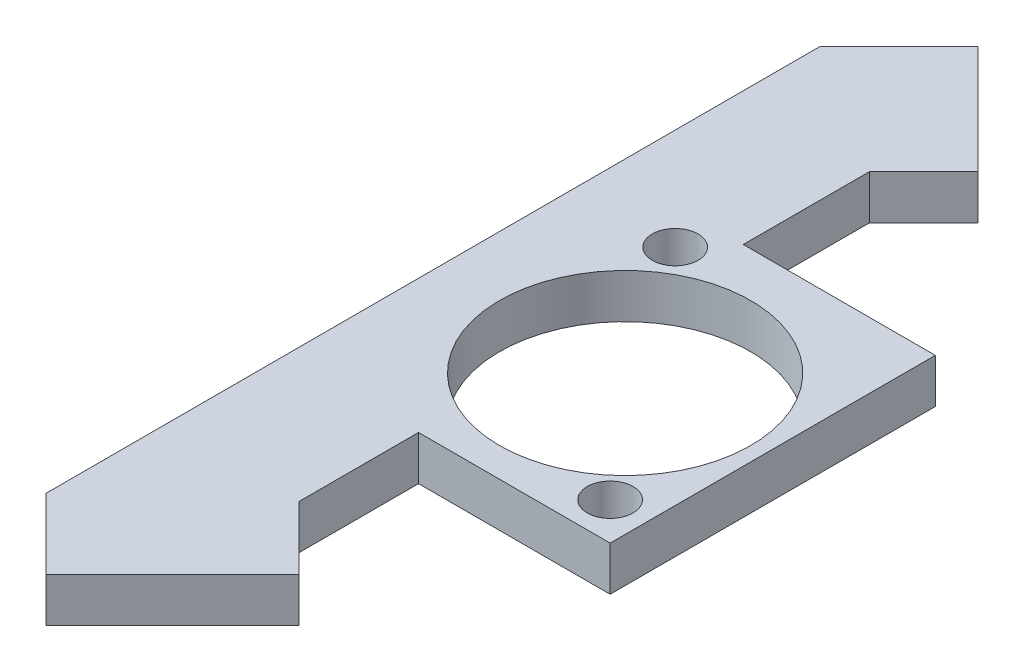
ISO-10303-21;
HEADER;
FILE_DESCRIPTION(('STEP AP214'),'2;1');
FILE_NAME('part.step','',(''),(''),'','','');
FILE_SCHEMA(('AUTOMOTIVE_DESIGN { 1 0 10303 214 1 1 1 1 }'));
ENDSEC;
DATA;
#1=APPLICATION_CONTEXT('core data for automotive mechanical design processes');
#2=APPLICATION_PROTOCOL_DEFINITION('international standard','automotive_design',2000,#1);
#3=PRODUCT_CONTEXT('',#1,'mechanical');
#4=PRODUCT('Part','Part','',(#3));
#5=PRODUCT_RELATED_PRODUCT_CATEGORY('part','',(#4));
#6=PRODUCT_DEFINITION_FORMATION('','',#4);
#7=PRODUCT_DEFINITION_CONTEXT('part definition',#1,'design');
#8=PRODUCT_DEFINITION('design','',#6,#7);
#9=PRODUCT_DEFINITION_SHAPE('','',#8);
#10=(LENGTH_UNIT() NAMED_UNIT(*) SI_UNIT(.MILLI.,.METRE.));
#11=(NAMED_UNIT(*) PLANE_ANGLE_UNIT() SI_UNIT($,.RADIAN.));
#12=(NAMED_UNIT(*) SI_UNIT($,.STERADIAN.) SOLID_ANGLE_UNIT());
#13=UNCERTAINTY_MEASURE_WITH_UNIT(LENGTH_MEASURE(1.E-05),#10,'distance_accuracy_value','');
#14=(GEOMETRIC_REPRESENTATION_CONTEXT(3) GLOBAL_UNCERTAINTY_ASSIGNED_CONTEXT((#13)) GLOBAL_UNIT_ASSIGNED_CONTEXT((#10,
#11,#12)) REPRESENTATION_CONTEXT('',''));
#15=CARTESIAN_POINT('',(0.,0.,0.));
#16=DIRECTION('',(0.,0.,1.));
#17=DIRECTION('',(1.,0.,0.));
#18=AXIS2_PLACEMENT_3D('',#15,#16,#17);
#19=CARTESIAN_POINT('',(-38.7655858067089,3.,-0.176708997531649));
#20=DIRECTION('',(0.,0.,-1.));
#21=DIRECTION('',(-1.,0.,0.));
#22=AXIS2_PLACEMENT_3D('',#19,#20,#21);
#23=PLANE('',#22);
#24=DIRECTION('',(0.,1.,0.));
#25=VECTOR('',#24,1.);
#26=CARTESIAN_POINT('',(-29.7285313034324,0.,-0.176708997531649));
#27=LINE('',#26,#25);
#28=CARTESIAN_POINT('',(-29.7285313034324,0.,-0.176708997531649));
#29=VERTEX_POINT('',#28);
#30=CARTESIAN_POINT('',(-29.7285313034324,3.,-0.176708997531649));
#31=VERTEX_POINT('',#30);
#32=EDGE_CURVE('E61',#29,#31,#27,.T.);
#33=ORIENTED_EDGE('',*,*,#32,.F.);
#34=DIRECTION('',(1.,0.,0.));
#35=VECTOR('',#34,1.);
#36=CARTESIAN_POINT('',(-38.7655858067089,0.,-0.176708997531649));
#37=LINE('',#36,#35);
#38=CARTESIAN_POINT('',(-16.7655858067089,0.,-0.176708997531649));
#39=VERTEX_POINT('',#38);
#40=EDGE_CURVE('E157',#29,#39,#37,.T.);
#41=ORIENTED_EDGE('',*,*,#40,.T.);
#42=DIRECTION('',(0.,-1.,0.));
#43=VECTOR('',#42,1.);
#44=CARTESIAN_POINT('',(-16.7655858067089,3.,-0.176708997531649));
#45=LINE('',#44,#43);
#46=CARTESIAN_POINT('',(-16.7655858067089,3.,-0.176708997531649));
#47=VERTEX_POINT('',#46);
#48=EDGE_CURVE('E12',#47,#39,#45,.T.);
#49=ORIENTED_EDGE('',*,*,#48,.F.);
#50=DIRECTION('',(1.,0.,0.));
#51=VECTOR('',#50,1.);
#52=CARTESIAN_POINT('',(-38.7655858067089,3.,-0.176708997531649));
#53=LINE('',#52,#51);
#54=EDGE_CURVE('E155',#31,#47,#53,.T.);
#55=ORIENTED_EDGE('',*,*,#54,.F.);
#56=EDGE_LOOP('',(#33,#41,#49,#55));
#57=FACE_BOUND('',#56,.T.);
#58=ADVANCED_FACE('F38',(#57),#23,.F.);
#59=CARTESIAN_POINT('',(0.,3.,0.));
#60=DIRECTION('',(0.,1.,0.));
#61=DIRECTION('',(0.,0.,1.));
#62=AXIS2_PLACEMENT_3D('',#59,#60,#61);
#63=PLANE('',#62);
#64=CARTESIAN_POINT('',(-19.3055858067089,3.,-2.71670899753165));
#65=DIRECTION('',(0.,1.,0.));
#66=DIRECTION('',(0.,0.,1.));
#67=AXIS2_PLACEMENT_3D('',#64,#65,#66);
#68=CIRCLE('',#67,1.55);
#69=CARTESIAN_POINT('',(-19.3055858067089,3.,-1.16670899753165));
#70=VERTEX_POINT('',#69);
#71=EDGE_CURVE('E208',#70,#70,#68,.T.);
#72=ORIENTED_EDGE('',*,*,#71,.F.);
#73=EDGE_LOOP('',(#72));
#74=FACE_BOUND('',#73,.T.);
#75=DIRECTION('',(0.,0.,1.));
#76=VECTOR('',#75,1.);
#77=CARTESIAN_POINT('',(-38.7655858067089,3.,-22.1767089975316));
#78=LINE('',#77,#76);
#79=CARTESIAN_POINT('',(-38.7655858067089,3.,-36.3897025324134));
#80=VERTEX_POINT('',#79);
#81=CARTESIAN_POINT('',(-38.7655858067089,3.,15.9918306806642));
#82=VERTEX_POINT('',#81);
#83=EDGE_CURVE('E151',#80,#82,#78,.T.);
#84=ORIENTED_EDGE('',*,*,#83,.T.);
#85=DIRECTION('',(0.707106781186559,0.,0.707106781186536));
#86=VECTOR('',#85,1.);
#87=CARTESIAN_POINT('',(-38.7655858067089,3.,15.9918306806642));
#88=LINE('',#87,#86);
#89=CARTESIAN_POINT('',(-34.011681836265,3.,20.7457346511078));
#90=VERTEX_POINT('',#89);
#91=EDGE_CURVE('E218',#82,#90,#88,.T.);
#92=ORIENTED_EDGE('',*,*,#91,.T.);
#93=DIRECTION('',(0.707106781186536,0.,-0.707106781186559));
#94=VECTOR('',#93,1.);
#95=CARTESIAN_POINT('',(-34.011681836265,3.,20.7457346511078));
#96=LINE('',#95,#94);
#97=CARTESIAN_POINT('',(-25.4453807705997,3.,12.1794335854422));
#98=VERTEX_POINT('',#97);
#99=EDGE_CURVE('E223',#90,#98,#96,.T.);
#100=ORIENTED_EDGE('',*,*,#99,.T.);
#101=DIRECTION('',(-0.707106781186549,0.,-0.707106781186546));
#102=VECTOR('',#101,1.);
#103=CARTESIAN_POINT('',(-25.4453807705997,3.,12.1794335854422));
#104=LINE('',#103,#102);
#105=CARTESIAN_POINT('',(-29.7285313034324,3.,7.89628305260957));
#106=VERTEX_POINT('',#105);
#107=EDGE_CURVE('E231',#98,#106,#104,.T.);
#108=ORIENTED_EDGE('',*,*,#107,.T.);
#109=DIRECTION('',(0.,0.,-1.));
#110=VECTOR('',#109,1.);
#111=CARTESIAN_POINT('',(-29.7285313034324,3.,7.89628305260957));
#112=LINE('',#111,#110);
#113=EDGE_CURVE('E236',#106,#31,#112,.T.);
#114=ORIENTED_EDGE('',*,*,#113,.T.);
#115=ORIENTED_EDGE('',*,*,#54,.T.);
#116=DIRECTION('',(0.,0.,-1.));
#117=VECTOR('',#116,1.);
#118=CARTESIAN_POINT('',(-16.7655858067089,3.,-22.1767089975316));
#119=LINE('',#118,#117);
#120=CARTESIAN_POINT('',(-16.7655858067089,3.,-22.1767089975316));
#121=VERTEX_POINT('',#120);
#122=EDGE_CURVE('E162',#47,#121,#119,.T.);
#123=ORIENTED_EDGE('',*,*,#122,.T.);
#124=DIRECTION('',(-1.,0.,0.));
#125=VECTOR('',#124,1.);
#126=CARTESIAN_POINT('',(-38.7655858067089,3.,-22.1767089975316));
#127=LINE('',#126,#125);
#128=CARTESIAN_POINT('',(-29.7563955550999,3.,-22.1767089975316));
#129=VERTEX_POINT('',#128);
#130=EDGE_CURVE('E160',#121,#129,#127,.T.);
#131=ORIENTED_EDGE('',*,*,#130,.T.);
#132=DIRECTION('',(0.,0.,-1.));
#133=VECTOR('',#132,1.);
#134=CARTESIAN_POINT('',(-29.7563955550999,3.,-30.7161451526293));
#135=LINE('',#134,#133);
#136=CARTESIAN_POINT('',(-29.7563955550999,3.,-30.7161451526293));
#137=VERTEX_POINT('',#136);
#138=EDGE_CURVE('E53',#129,#137,#135,.T.);
#139=ORIENTED_EDGE('',*,*,#138,.T.);
#140=DIRECTION('',(0.707106781186548,0.,-0.707106781186546));
#141=VECTOR('',#140,1.);
#142=CARTESIAN_POINT('',(-26.0857086472516,3.,-34.3868320604776));
#143=LINE('',#142,#141);
#144=CARTESIAN_POINT('',(-26.0857086472516,3.,-34.3868320604776));
#145=VERTEX_POINT('',#144);
#146=EDGE_CURVE('E183',#137,#145,#143,.T.);
#147=ORIENTED_EDGE('',*,*,#146,.T.);
#148=DIRECTION('',(-0.707106781186556,0.,-0.707106781186539));
#149=VECTOR('',#148,1.);
#150=CARTESIAN_POINT('',(-33.4270824629483,3.,-41.7282058761741));
#151=LINE('',#150,#149);
#152=CARTESIAN_POINT('',(-33.4270824629483,3.,-41.7282058761741));
#153=VERTEX_POINT('',#152);
#154=EDGE_CURVE('E189',#145,#153,#151,.T.);
#155=ORIENTED_EDGE('',*,*,#154,.T.);
#156=DIRECTION('',(-0.707106781186539,0.,0.707106781186556));
#157=VECTOR('',#156,1.);
#158=CARTESIAN_POINT('',(-38.7655858067089,3.,-36.3897025324134));
#159=LINE('',#158,#157);
#160=EDGE_CURVE('E146',#153,#80,#159,.T.);
#161=ORIENTED_EDGE('',*,*,#160,.T.);
#162=EDGE_LOOP('',(#84,#92,#100,#108,#114,#115,#123,#131,#139,#147,#155,#161));
#163=FACE_BOUND('',#162,.T.);
#164=CARTESIAN_POINT('',(-26.2237014980214,3.,-10.648645814897));
#165=DIRECTION('',(0.,1.,0.));
#166=DIRECTION('',(0.,0.,1.));
#167=AXIS2_PLACEMENT_3D('',#164,#165,#166);
#168=CIRCLE('',#167,8.5);
#169=CARTESIAN_POINT('',(-26.2237014980214,3.,-2.14864581489702));
#170=VERTEX_POINT('',#169);
#171=EDGE_CURVE('E198',#170,#170,#168,.T.);
#172=ORIENTED_EDGE('',*,*,#171,.F.);
#173=EDGE_LOOP('',(#172));
#174=FACE_BOUND('',#173,.T.);
#175=CARTESIAN_POINT('',(-31.9055858067089,3.,-19.7167089975317));
#176=DIRECTION('',(0.,1.,0.));
#177=DIRECTION('',(0.,0.,1.));
#178=AXIS2_PLACEMENT_3D('',#175,#176,#177);
#179=CIRCLE('',#178,1.55);
#180=CARTESIAN_POINT('',(-31.9055858067089,3.,-18.1667089975317));
#181=VERTEX_POINT('',#180);
#182=EDGE_CURVE('E253',#181,#181,#179,.T.);
#183=ORIENTED_EDGE('',*,*,#182,.F.);
#184=EDGE_LOOP('',(#183));
#185=FACE_BOUND('',#184,.T.);
#186=ADVANCED_FACE('F284',(#74,#163,#174,#185),#63,.T.);
#187=CARTESIAN_POINT('',(0.,0.,0.));
#188=DIRECTION('',(0.,1.,0.));
#189=DIRECTION('',(0.,0.,1.));
#190=AXIS2_PLACEMENT_3D('',#187,#188,#189);
#191=PLANE('',#190);
#192=DIRECTION('',(0.,0.,1.));
#193=VECTOR('',#192,1.);
#194=CARTESIAN_POINT('',(-38.7655858067089,0.,-22.1767089975316));
#195=LINE('',#194,#193);
#196=CARTESIAN_POINT('',(-38.7655858067089,0.,-36.3897025324134));
#197=VERTEX_POINT('',#196);
#198=CARTESIAN_POINT('',(-38.7655858067089,0.,15.9918306806642));
#199=VERTEX_POINT('',#198);
#200=EDGE_CURVE('E172',#197,#199,#195,.T.);
#201=ORIENTED_EDGE('',*,*,#200,.F.);
#202=DIRECTION('',(-0.707106781186539,0.,0.707106781186556));
#203=VECTOR('',#202,1.);
#204=CARTESIAN_POINT('',(-38.7655858067089,0.,-36.3897025324134));
#205=LINE('',#204,#203);
#206=CARTESIAN_POINT('',(-33.4270824629483,0.,-41.7282058761741));
#207=VERTEX_POINT('',#206);
#208=EDGE_CURVE('E134',#207,#197,#205,.T.);
#209=ORIENTED_EDGE('',*,*,#208,.F.);
#210=DIRECTION('',(-0.707106781186556,0.,-0.707106781186539));
#211=VECTOR('',#210,1.);
#212=CARTESIAN_POINT('',(-33.4270824629483,0.,-41.7282058761741));
#213=LINE('',#212,#211);
#214=CARTESIAN_POINT('',(-26.0857086472516,0.,-34.3868320604776));
#215=VERTEX_POINT('',#214);
#216=EDGE_CURVE('E352',#215,#207,#213,.T.);
#217=ORIENTED_EDGE('',*,*,#216,.F.);
#218=DIRECTION('',(0.707106781186548,0.,-0.707106781186546));
#219=VECTOR('',#218,1.);
#220=CARTESIAN_POINT('',(-26.0857086472516,0.,-34.3868320604776));
#221=LINE('',#220,#219);
#222=CARTESIAN_POINT('',(-29.7563955550999,0.,-30.7161451526293));
#223=VERTEX_POINT('',#222);
#224=EDGE_CURVE('E145',#223,#215,#221,.T.);
#225=ORIENTED_EDGE('',*,*,#224,.F.);
#226=DIRECTION('',(0.,0.,-1.));
#227=VECTOR('',#226,1.);
#228=CARTESIAN_POINT('',(-29.7563955550999,0.,-30.7161451526293));
#229=LINE('',#228,#227);
#230=CARTESIAN_POINT('',(-29.7563955550999,0.,-22.1767089975316));
#231=VERTEX_POINT('',#230);
#232=EDGE_CURVE('E128',#231,#223,#229,.T.);
#233=ORIENTED_EDGE('',*,*,#232,.F.);
#234=DIRECTION('',(-1.,0.,0.));
#235=VECTOR('',#234,1.);
#236=CARTESIAN_POINT('',(-38.7655858067089,0.,-22.1767089975316));
#237=LINE('',#236,#235);
#238=CARTESIAN_POINT('',(-16.7655858067089,0.,-22.1767089975316));
#239=VERTEX_POINT('',#238);
#240=EDGE_CURVE('E142',#239,#231,#237,.T.);
#241=ORIENTED_EDGE('',*,*,#240,.F.);
#242=DIRECTION('',(0.,0.,-1.));
#243=VECTOR('',#242,1.);
#244=CARTESIAN_POINT('',(-16.7655858067089,0.,-22.1767089975316));
#245=LINE('',#244,#243);
#246=EDGE_CURVE('E152',#39,#239,#245,.T.);
#247=ORIENTED_EDGE('',*,*,#246,.F.);
#248=ORIENTED_EDGE('',*,*,#40,.F.);
#249=DIRECTION('',(0.,0.,-1.));
#250=VECTOR('',#249,1.);
#251=CARTESIAN_POINT('',(-29.7285313034324,0.,7.89628305260957));
#252=LINE('',#251,#250);
#253=CARTESIAN_POINT('',(-29.7285313034324,0.,7.89628305260957));
#254=VERTEX_POINT('',#253);
#255=EDGE_CURVE('E225',#254,#29,#252,.T.);
#256=ORIENTED_EDGE('',*,*,#255,.F.);
#257=DIRECTION('',(-0.707106781186549,0.,-0.707106781186546));
#258=VECTOR('',#257,1.);
#259=CARTESIAN_POINT('',(-25.4453807705997,0.,12.1794335854422));
#260=LINE('',#259,#258);
#261=CARTESIAN_POINT('',(-25.4453807705997,0.,12.1794335854422));
#262=VERTEX_POINT('',#261);
#263=EDGE_CURVE('E319',#262,#254,#260,.T.);
#264=ORIENTED_EDGE('',*,*,#263,.F.);
#265=DIRECTION('',(0.707106781186536,0.,-0.707106781186559));
#266=VECTOR('',#265,1.);
#267=CARTESIAN_POINT('',(-34.011681836265,0.,20.7457346511078));
#268=LINE('',#267,#266);
#269=CARTESIAN_POINT('',(-34.011681836265,0.,20.7457346511078));
#270=VERTEX_POINT('',#269);
#271=EDGE_CURVE('E317',#270,#262,#268,.T.);
#272=ORIENTED_EDGE('',*,*,#271,.F.);
#273=DIRECTION('',(0.707106781186559,0.,0.707106781186536));
#274=VECTOR('',#273,1.);
#275=CARTESIAN_POINT('',(-38.7655858067089,0.,15.9918306806642));
#276=LINE('',#275,#274);
#277=EDGE_CURVE('E242',#199,#270,#276,.T.);
#278=ORIENTED_EDGE('',*,*,#277,.F.);
#279=EDGE_LOOP('',(#201,#209,#217,#225,#233,#241,#247,#248,#256,#264,#272,#278));
#280=FACE_BOUND('',#279,.T.);
#281=CARTESIAN_POINT('',(-26.2237014980214,0.,-10.648645814897));
#282=DIRECTION('',(0.,1.,0.));
#283=DIRECTION('',(0.,0.,1.));
#284=AXIS2_PLACEMENT_3D('',#281,#282,#283);
#285=CIRCLE('',#284,8.5);
#286=CARTESIAN_POINT('',(-26.2237014980214,0.,-2.14864581489702));
#287=VERTEX_POINT('',#286);
#288=EDGE_CURVE('E204',#287,#287,#285,.T.);
#289=ORIENTED_EDGE('',*,*,#288,.T.);
#290=EDGE_LOOP('',(#289));
#291=FACE_BOUND('',#290,.T.);
#292=CARTESIAN_POINT('',(-19.3055858067089,0.,-2.71670899753165));
#293=DIRECTION('',(0.,1.,0.));
#294=DIRECTION('',(0.,0.,1.));
#295=AXIS2_PLACEMENT_3D('',#292,#293,#294);
#296=CIRCLE('',#295,1.55);
#297=CARTESIAN_POINT('',(-19.3055858067089,0.,-1.16670899753165));
#298=VERTEX_POINT('',#297);
#299=EDGE_CURVE('E205',#298,#298,#296,.T.);
#300=ORIENTED_EDGE('',*,*,#299,.T.);
#301=EDGE_LOOP('',(#300));
#302=FACE_BOUND('',#301,.T.);
#303=CARTESIAN_POINT('',(-31.9055858067089,0.,-19.7167089975317));
#304=DIRECTION('',(0.,1.,0.));
#305=DIRECTION('',(0.,0.,1.));
#306=AXIS2_PLACEMENT_3D('',#303,#304,#305);
#307=CIRCLE('',#306,1.55);
#308=CARTESIAN_POINT('',(-31.9055858067089,0.,-18.1667089975317));
#309=VERTEX_POINT('',#308);
#310=EDGE_CURVE('E244',#309,#309,#307,.T.);
#311=ORIENTED_EDGE('',*,*,#310,.T.);
#312=EDGE_LOOP('',(#311));
#313=FACE_BOUND('',#312,.T.);
#314=ADVANCED_FACE('F139',(#280,#291,#302,#313),#191,.F.);
#315=CARTESIAN_POINT('',(-38.7655858067089,3.,-22.1767089975316));
#316=DIRECTION('',(1.,0.,0.));
#317=DIRECTION('',(0.,0.,-1.));
#318=AXIS2_PLACEMENT_3D('',#315,#316,#317);
#319=PLANE('',#318);
#320=ORIENTED_EDGE('',*,*,#200,.T.);
#321=DIRECTION('',(0.,1.,0.));
#322=VECTOR('',#321,1.);
#323=CARTESIAN_POINT('',(-38.7655858067089,0.,15.9918306806642));
#324=LINE('',#323,#322);
#325=EDGE_CURVE('E251',#199,#82,#324,.T.);
#326=ORIENTED_EDGE('',*,*,#325,.T.);
#327=ORIENTED_EDGE('',*,*,#83,.F.);
#328=DIRECTION('',(0.,1.,0.));
#329=VECTOR('',#328,1.);
#330=CARTESIAN_POINT('',(-38.7655858067089,0.,-36.3897025324134));
#331=LINE('',#330,#329);
#332=EDGE_CURVE('E224',#197,#80,#331,.T.);
#333=ORIENTED_EDGE('',*,*,#332,.F.);
#334=EDGE_LOOP('',(#320,#326,#327,#333));
#335=FACE_BOUND('',#334,.T.);
#336=ADVANCED_FACE('F40',(#335),#319,.F.);
#337=CARTESIAN_POINT('',(-16.7655858067089,3.,-22.1767089975316));
#338=DIRECTION('',(-1.,0.,0.));
#339=DIRECTION('',(0.,0.,1.));
#340=AXIS2_PLACEMENT_3D('',#337,#338,#339);
#341=PLANE('',#340);
#342=ORIENTED_EDGE('',*,*,#246,.T.);
#343=DIRECTION('',(0.,-1.,0.));
#344=VECTOR('',#343,1.);
#345=CARTESIAN_POINT('',(-16.7655858067089,3.,-22.1767089975316));
#346=LINE('',#345,#344);
#347=EDGE_CURVE('E46',#121,#239,#346,.T.);
#348=ORIENTED_EDGE('',*,*,#347,.F.);
#349=ORIENTED_EDGE('',*,*,#122,.F.);
#350=ORIENTED_EDGE('',*,*,#48,.T.);
#351=EDGE_LOOP('',(#342,#348,#349,#350));
#352=FACE_BOUND('',#351,.T.);
#353=ADVANCED_FACE('F291',(#352),#341,.F.);
#354=CARTESIAN_POINT('',(-38.7655858067089,3.,-22.1767089975316));
#355=DIRECTION('',(0.,0.,1.));
#356=DIRECTION('',(1.,0.,0.));
#357=AXIS2_PLACEMENT_3D('',#354,#355,#356);
#358=PLANE('',#357);
#359=ORIENTED_EDGE('',*,*,#240,.T.);
#360=DIRECTION('',(0.,1.,0.));
#361=VECTOR('',#360,1.);
#362=CARTESIAN_POINT('',(-29.7563955550999,0.,-22.1767089975316));
#363=LINE('',#362,#361);
#364=EDGE_CURVE('E125',#231,#129,#363,.T.);
#365=ORIENTED_EDGE('',*,*,#364,.T.);
#366=ORIENTED_EDGE('',*,*,#130,.F.);
#367=ORIENTED_EDGE('',*,*,#347,.T.);
#368=EDGE_LOOP('',(#359,#365,#366,#367));
#369=FACE_BOUND('',#368,.T.);
#370=ADVANCED_FACE('F149',(#369),#358,.F.);
#371=CARTESIAN_POINT('',(-26.2237014980214,3.,-10.648645814897));
#372=DIRECTION('',(0.,-1.,0.));
#373=DIRECTION('',(0.,0.,-1.));
#374=AXIS2_PLACEMENT_3D('',#371,#372,#373);
#375=CYLINDRICAL_SURFACE('',#374,8.5);
#376=ORIENTED_EDGE('',*,*,#171,.T.);
#377=EDGE_LOOP('',(#376));
#378=FACE_BOUND('',#377,.T.);
#379=ORIENTED_EDGE('',*,*,#288,.F.);
#380=EDGE_LOOP('',(#379));
#381=FACE_BOUND('',#380,.T.);
#382=ADVANCED_FACE('F272',(#378,#381),#375,.F.);
#383=CARTESIAN_POINT('',(-19.3055858067089,3.,-2.71670899753165));
#384=DIRECTION('',(0.,-1.,0.));
#385=DIRECTION('',(0.,0.,-1.));
#386=AXIS2_PLACEMENT_3D('',#383,#384,#385);
#387=CYLINDRICAL_SURFACE('',#386,1.55);
#388=ORIENTED_EDGE('',*,*,#71,.T.);
#389=EDGE_LOOP('',(#388));
#390=FACE_BOUND('',#389,.T.);
#391=ORIENTED_EDGE('',*,*,#299,.F.);
#392=EDGE_LOOP('',(#391));
#393=FACE_BOUND('',#392,.T.);
#394=ADVANCED_FACE('F269',(#390,#393),#387,.F.);
#395=CARTESIAN_POINT('',(-31.9055858067089,3.,-19.7167089975317));
#396=DIRECTION('',(0.,-1.,0.));
#397=DIRECTION('',(0.,0.,-1.));
#398=AXIS2_PLACEMENT_3D('',#395,#396,#397);
#399=CYLINDRICAL_SURFACE('',#398,1.55);
#400=ORIENTED_EDGE('',*,*,#182,.T.);
#401=EDGE_LOOP('',(#400));
#402=FACE_BOUND('',#401,.T.);
#403=ORIENTED_EDGE('',*,*,#310,.F.);
#404=EDGE_LOOP('',(#403));
#405=FACE_BOUND('',#404,.T.);
#406=ADVANCED_FACE('F271',(#402,#405),#399,.F.);
#407=CARTESIAN_POINT('',(-29.7285313034324,0.,7.89628305260957));
#408=DIRECTION('',(1.,0.,0.));
#409=DIRECTION('',(0.,0.,-1.));
#410=AXIS2_PLACEMENT_3D('',#407,#408,#409);
#411=PLANE('',#410);
#412=ORIENTED_EDGE('',*,*,#113,.F.);
#413=DIRECTION('',(0.,1.,0.));
#414=VECTOR('',#413,1.);
#415=CARTESIAN_POINT('',(-29.7285313034324,0.,7.89628305260957));
#416=LINE('',#415,#414);
#417=EDGE_CURVE('E245',#254,#106,#416,.T.);
#418=ORIENTED_EDGE('',*,*,#417,.F.);
#419=ORIENTED_EDGE('',*,*,#255,.T.);
#420=ORIENTED_EDGE('',*,*,#32,.T.);
#421=EDGE_LOOP('',(#412,#418,#419,#420));
#422=FACE_BOUND('',#421,.T.);
#423=ADVANCED_FACE('F278',(#422),#411,.T.);
#424=CARTESIAN_POINT('',(-25.4453807705997,0.,12.1794335854422));
#425=DIRECTION('',(0.707106781186546,0.,-0.707106781186549));
#426=DIRECTION('',(-0.707106781186549,0.,-0.707106781186546));
#427=AXIS2_PLACEMENT_3D('',#424,#425,#426);
#428=PLANE('',#427);
#429=ORIENTED_EDGE('',*,*,#107,.F.);
#430=DIRECTION('',(0.,1.,0.));
#431=VECTOR('',#430,1.);
#432=CARTESIAN_POINT('',(-25.4453807705997,0.,12.1794335854422));
#433=LINE('',#432,#431);
#434=EDGE_CURVE('E247',#262,#98,#433,.T.);
#435=ORIENTED_EDGE('',*,*,#434,.F.);
#436=ORIENTED_EDGE('',*,*,#263,.T.);
#437=ORIENTED_EDGE('',*,*,#417,.T.);
#438=EDGE_LOOP('',(#429,#435,#436,#437));
#439=FACE_BOUND('',#438,.T.);
#440=ADVANCED_FACE('F334',(#439),#428,.T.);
#441=CARTESIAN_POINT('',(-34.011681836265,0.,20.7457346511078));
#442=DIRECTION('',(0.707106781186559,0.,0.707106781186536));
#443=DIRECTION('',(0.707106781186536,0.,-0.707106781186559));
#444=AXIS2_PLACEMENT_3D('',#441,#442,#443);
#445=PLANE('',#444);
#446=ORIENTED_EDGE('',*,*,#99,.F.);
#447=DIRECTION('',(0.,1.,0.));
#448=VECTOR('',#447,1.);
#449=CARTESIAN_POINT('',(-34.011681836265,0.,20.7457346511078));
#450=LINE('',#449,#448);
#451=EDGE_CURVE('E249',#270,#90,#450,.T.);
#452=ORIENTED_EDGE('',*,*,#451,.F.);
#453=ORIENTED_EDGE('',*,*,#271,.T.);
#454=ORIENTED_EDGE('',*,*,#434,.T.);
#455=EDGE_LOOP('',(#446,#452,#453,#454));
#456=FACE_BOUND('',#455,.T.);
#457=ADVANCED_FACE('F336',(#456),#445,.T.);
#458=CARTESIAN_POINT('',(-38.7655858067089,0.,15.9918306806642));
#459=DIRECTION('',(-0.707106781186536,0.,0.707106781186559));
#460=DIRECTION('',(0.707106781186559,0.,0.707106781186536));
#461=AXIS2_PLACEMENT_3D('',#458,#459,#460);
#462=PLANE('',#461);
#463=ORIENTED_EDGE('',*,*,#91,.F.);
#464=ORIENTED_EDGE('',*,*,#325,.F.);
#465=ORIENTED_EDGE('',*,*,#277,.T.);
#466=ORIENTED_EDGE('',*,*,#451,.T.);
#467=EDGE_LOOP('',(#463,#464,#465,#466));
#468=FACE_BOUND('',#467,.T.);
#469=ADVANCED_FACE('F313',(#468),#462,.T.);
#470=CARTESIAN_POINT('',(-38.7655858067089,0.,-36.3897025324134));
#471=DIRECTION('',(-0.707106781186556,0.,-0.707106781186539));
#472=DIRECTION('',(-0.707106781186539,0.,0.707106781186556));
#473=AXIS2_PLACEMENT_3D('',#470,#471,#472);
#474=PLANE('',#473);
#475=ORIENTED_EDGE('',*,*,#160,.F.);
#476=DIRECTION('',(0.,1.,0.));
#477=VECTOR('',#476,1.);
#478=CARTESIAN_POINT('',(-33.4270824629483,0.,-41.7282058761741));
#479=LINE('',#478,#477);
#480=EDGE_CURVE('E341',#207,#153,#479,.T.);
#481=ORIENTED_EDGE('',*,*,#480,.F.);
#482=ORIENTED_EDGE('',*,*,#208,.T.);
#483=ORIENTED_EDGE('',*,*,#332,.T.);
#484=EDGE_LOOP('',(#475,#481,#482,#483));
#485=FACE_BOUND('',#484,.T.);
#486=ADVANCED_FACE('F340',(#485),#474,.T.);
#487=CARTESIAN_POINT('',(-33.4270824629483,0.,-41.7282058761741));
#488=DIRECTION('',(0.707106781186539,0.,-0.707106781186556));
#489=DIRECTION('',(-0.707106781186556,0.,-0.707106781186539));
#490=AXIS2_PLACEMENT_3D('',#487,#488,#489);
#491=PLANE('',#490);
#492=ORIENTED_EDGE('',*,*,#154,.F.);
#493=DIRECTION('',(0.,1.,0.));
#494=VECTOR('',#493,1.);
#495=CARTESIAN_POINT('',(-26.0857086472516,0.,-34.3868320604776));
#496=LINE('',#495,#494);
#497=EDGE_CURVE('E342',#215,#145,#496,.T.);
#498=ORIENTED_EDGE('',*,*,#497,.F.);
#499=ORIENTED_EDGE('',*,*,#216,.T.);
#500=ORIENTED_EDGE('',*,*,#480,.T.);
#501=EDGE_LOOP('',(#492,#498,#499,#500));
#502=FACE_BOUND('',#501,.T.);
#503=ADVANCED_FACE('F350',(#502),#491,.T.);
#504=CARTESIAN_POINT('',(-26.0857086472516,0.,-34.3868320604776));
#505=DIRECTION('',(0.707106781186546,0.,0.707106781186549));
#506=DIRECTION('',(0.707106781186549,0.,-0.707106781186546));
#507=AXIS2_PLACEMENT_3D('',#504,#505,#506);
#508=PLANE('',#507);
#509=ORIENTED_EDGE('',*,*,#146,.F.);
#510=DIRECTION('',(0.,1.,0.));
#511=VECTOR('',#510,1.);
#512=CARTESIAN_POINT('',(-29.7563955550999,0.,-30.7161451526293));
#513=LINE('',#512,#511);
#514=EDGE_CURVE('E133',#223,#137,#513,.T.);
#515=ORIENTED_EDGE('',*,*,#514,.F.);
#516=ORIENTED_EDGE('',*,*,#224,.T.);
#517=ORIENTED_EDGE('',*,*,#497,.T.);
#518=EDGE_LOOP('',(#509,#515,#516,#517));
#519=FACE_BOUND('',#518,.T.);
#520=ADVANCED_FACE('F347',(#519),#508,.T.);
#521=CARTESIAN_POINT('',(-29.7563955550999,0.,-30.7161451526293));
#522=DIRECTION('',(1.,0.,0.));
#523=DIRECTION('',(0.,0.,-1.));
#524=AXIS2_PLACEMENT_3D('',#521,#522,#523);
#525=PLANE('',#524);
#526=ORIENTED_EDGE('',*,*,#138,.F.);
#527=ORIENTED_EDGE('',*,*,#364,.F.);
#528=ORIENTED_EDGE('',*,*,#232,.T.);
#529=ORIENTED_EDGE('',*,*,#514,.T.);
#530=EDGE_LOOP('',(#526,#527,#528,#529));
#531=FACE_BOUND('',#530,.T.);
#532=ADVANCED_FACE('F127',(#531),#525,.T.);
#533=CLOSED_SHELL('',(#58,#186,#314,#336,#353,#370,#382,#394,#406,#423,#440,#457,#469,#486,#503,
#520,#532));
#534=MANIFOLD_SOLID_BREP('B2',#533);
#535=ADVANCED_BREP_SHAPE_REPRESENTATION('',(#18,#534),#14);
#536=SHAPE_DEFINITION_REPRESENTATION(#9,#535);
ENDSEC;
END-ISO-10303-21;
